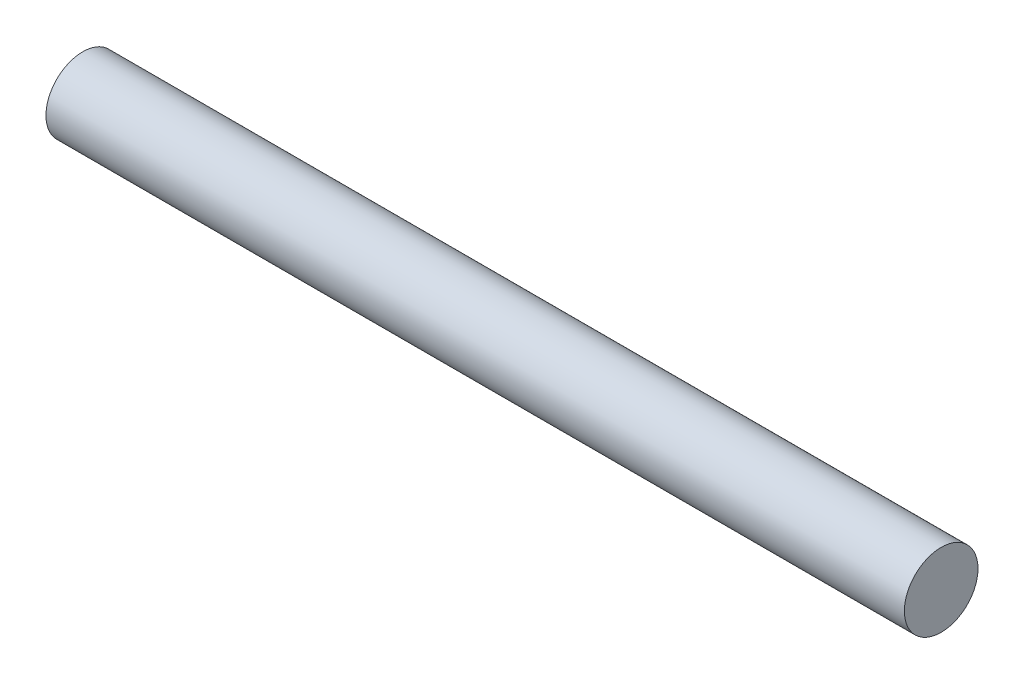
ISO-10303-21;
HEADER;
FILE_DESCRIPTION(('STEP AP214'),'2;1');
FILE_NAME('part.step','',(''),(''),'','','');
FILE_SCHEMA(('AUTOMOTIVE_DESIGN { 1 0 10303 214 1 1 1 1 }'));
ENDSEC;
DATA;
#1=APPLICATION_CONTEXT('core data for automotive mechanical design processes');
#2=APPLICATION_PROTOCOL_DEFINITION('international standard','automotive_design',2000,#1);
#3=PRODUCT_CONTEXT('',#1,'mechanical');
#4=PRODUCT('Part','Part','',(#3));
#5=PRODUCT_RELATED_PRODUCT_CATEGORY('part','',(#4));
#6=PRODUCT_DEFINITION_FORMATION('','',#4);
#7=PRODUCT_DEFINITION_CONTEXT('part definition',#1,'design');
#8=PRODUCT_DEFINITION('design','',#6,#7);
#9=PRODUCT_DEFINITION_SHAPE('','',#8);
#10=(LENGTH_UNIT() NAMED_UNIT(*) SI_UNIT(.MILLI.,.METRE.));
#11=(NAMED_UNIT(*) PLANE_ANGLE_UNIT() SI_UNIT($,.RADIAN.));
#12=(NAMED_UNIT(*) SI_UNIT($,.STERADIAN.) SOLID_ANGLE_UNIT());
#13=UNCERTAINTY_MEASURE_WITH_UNIT(LENGTH_MEASURE(1.E-05),#10,'distance_accuracy_value','');
#14=(GEOMETRIC_REPRESENTATION_CONTEXT(3) GLOBAL_UNCERTAINTY_ASSIGNED_CONTEXT((#13)) GLOBAL_UNIT_ASSIGNED_CONTEXT((#10,
#11,#12)) REPRESENTATION_CONTEXT('',''));
#15=CARTESIAN_POINT('',(0.,0.,0.));
#16=DIRECTION('',(0.,0.,1.));
#17=DIRECTION('',(1.,0.,0.));
#18=AXIS2_PLACEMENT_3D('',#15,#16,#17);
#19=CARTESIAN_POINT('',(515.999999999963,157.5,0.));
#20=DIRECTION('',(1.,0.,0.));
#21=DIRECTION('',(0.,0.,-1.));
#22=AXIS2_PLACEMENT_3D('',#19,#20,#21);
#23=CONICAL_SURFACE('',#22,3.43222831443882,1.20575455667786);
#24=CARTESIAN_POINT('',(514.688305550578,157.49999999943,0.));
#25=VERTEX_POINT('',#24);
#26=VERTEX_LOOP('',#25);
#27=FACE_BOUND('',#26,.T.);
#28=CARTESIAN_POINT('',(516.,157.5,0.));
#29=DIRECTION('',(1.,0.,0.));
#30=DIRECTION('',(0.,0.,-1.));
#31=AXIS2_PLACEMENT_3D('',#28,#29,#30);
#32=CIRCLE('',#31,3.43222831456501);
#33=CARTESIAN_POINT('',(516.,157.5,-3.43222831456501));
#34=VERTEX_POINT('',#33);
#35=EDGE_CURVE('E23',#34,#34,#32,.T.);
#36=ORIENTED_EDGE('',*,*,#35,.F.);
#37=EDGE_LOOP('',(#36));
#38=FACE_BOUND('',#37,.T.);
#39=ADVANCED_FACE('F17',(#27,#38),#23,.T.);
#40=CARTESIAN_POINT('',(596.,159.216114157283,0.));
#41=DIRECTION('',(-1.,0.,0.));
#42=DIRECTION('',(0.,0.,1.));
#43=AXIS2_PLACEMENT_3D('',#40,#41,#42);
#44=PLANE('',#43);
#45=CARTESIAN_POINT('',(596.,157.5,0.));
#46=DIRECTION('',(1.,0.,0.));
#47=DIRECTION('',(0.,0.,-1.));
#48=AXIS2_PLACEMENT_3D('',#45,#46,#47);
#49=CIRCLE('',#48,3.43222831456501);
#50=CARTESIAN_POINT('',(596.,157.5,-3.43222831456501));
#51=VERTEX_POINT('',#50);
#52=EDGE_CURVE('E11',#51,#51,#49,.F.);
#53=ORIENTED_EDGE('',*,*,#52,.F.);
#54=EDGE_LOOP('',(#53));
#55=FACE_BOUND('',#54,.T.);
#56=ADVANCED_FACE('F28',(#55),#44,.F.);
#57=CARTESIAN_POINT('',(542.,157.5,0.));
#58=DIRECTION('',(1.,0.,0.));
#59=DIRECTION('',(0.,0.,-1.));
#60=AXIS2_PLACEMENT_3D('',#57,#58,#59);
#61=CYLINDRICAL_SURFACE('',#60,3.43222831456501);
#62=ORIENTED_EDGE('',*,*,#52,.T.);
#63=EDGE_LOOP('',(#62));
#64=FACE_BOUND('',#63,.T.);
#65=ORIENTED_EDGE('',*,*,#35,.T.);
#66=EDGE_LOOP('',(#65));
#67=FACE_BOUND('',#66,.T.);
#68=ADVANCED_FACE('F32',(#64,#67),#61,.T.);
#69=CLOSED_SHELL('',(#39,#56,#68));
#70=MANIFOLD_SOLID_BREP('B1',#69);
#71=ADVANCED_BREP_SHAPE_REPRESENTATION('',(#18,#70),#14);
#72=SHAPE_DEFINITION_REPRESENTATION(#9,#71);
ENDSEC;
END-ISO-10303-21;
